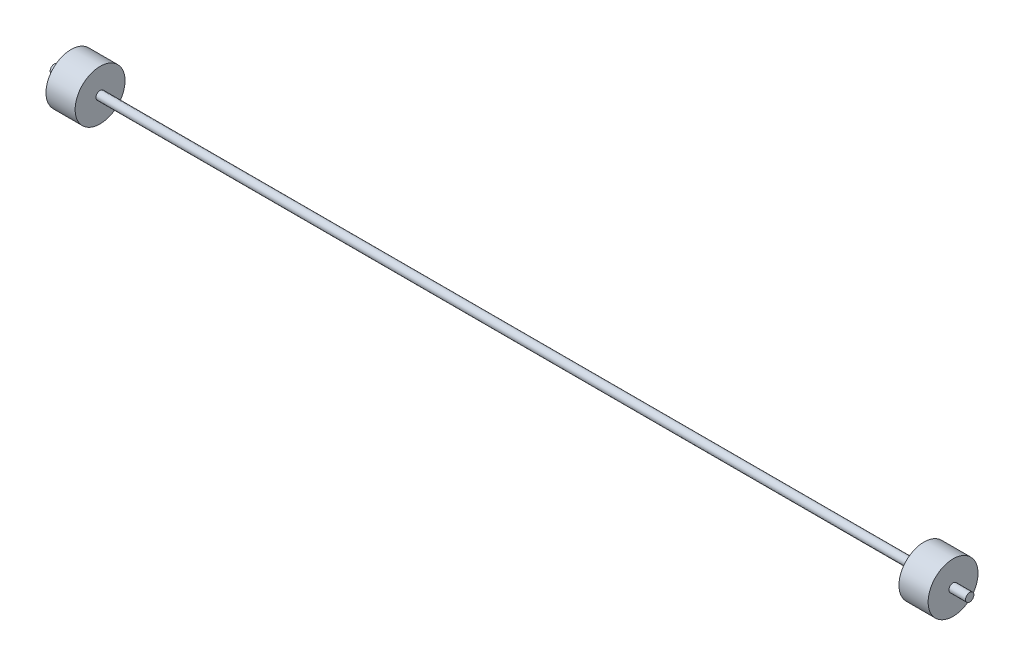
ISO-10303-21;
HEADER;
FILE_DESCRIPTION(('STEP AP214'),'2;1');
FILE_NAME('part.step','',(''),(''),'','','');
FILE_SCHEMA(('AUTOMOTIVE_DESIGN { 1 0 10303 214 1 1 1 1 }'));
ENDSEC;
DATA;
#1=APPLICATION_CONTEXT('core data for automotive mechanical design processes');
#2=APPLICATION_PROTOCOL_DEFINITION('international standard','automotive_design',2000,#1);
#3=PRODUCT_CONTEXT('',#1,'mechanical');
#4=PRODUCT('Part','Part','',(#3));
#5=PRODUCT_RELATED_PRODUCT_CATEGORY('part','',(#4));
#6=PRODUCT_DEFINITION_FORMATION('','',#4);
#7=PRODUCT_DEFINITION_CONTEXT('part definition',#1,'design');
#8=PRODUCT_DEFINITION('design','',#6,#7);
#9=PRODUCT_DEFINITION_SHAPE('','',#8);
#10=(LENGTH_UNIT() NAMED_UNIT(*) SI_UNIT(.MILLI.,.METRE.));
#11=(NAMED_UNIT(*) PLANE_ANGLE_UNIT() SI_UNIT($,.RADIAN.));
#12=(NAMED_UNIT(*) SI_UNIT($,.STERADIAN.) SOLID_ANGLE_UNIT());
#13=UNCERTAINTY_MEASURE_WITH_UNIT(LENGTH_MEASURE(1.E-05),#10,'distance_accuracy_value','');
#14=(GEOMETRIC_REPRESENTATION_CONTEXT(3) GLOBAL_UNCERTAINTY_ASSIGNED_CONTEXT((#13)) GLOBAL_UNIT_ASSIGNED_CONTEXT((#10,
#11,#12)) REPRESENTATION_CONTEXT('',''));
#15=CARTESIAN_POINT('',(0.,0.,0.));
#16=DIRECTION('',(0.,0.,1.));
#17=DIRECTION('',(1.,0.,0.));
#18=AXIS2_PLACEMENT_3D('',#15,#16,#17);
#19=CARTESIAN_POINT('',(-307.761103786618,76.2,0.));
#20=DIRECTION('',(-1.,0.,0.));
#21=DIRECTION('',(0.,0.,1.));
#22=AXIS2_PLACEMENT_3D('',#19,#20,#21);
#23=PLANE('',#22);
#24=CARTESIAN_POINT('',(-307.761103786618,0.,0.));
#25=DIRECTION('',(-1.,0.,0.));
#26=DIRECTION('',(0.,0.,1.));
#27=AXIS2_PLACEMENT_3D('',#24,#25,#26);
#28=CIRCLE('',#27,76.2);
#29=CARTESIAN_POINT('',(-307.761103786618,0.,76.2));
#30=VERTEX_POINT('',#29);
#31=EDGE_CURVE('E10',#30,#30,#28,.T.);
#32=ORIENTED_EDGE('',*,*,#31,.F.);
#33=EDGE_LOOP('',(#32));
#34=FACE_BOUND('',#33,.T.);
#35=CARTESIAN_POINT('',(-307.761103786618,0.,0.));
#36=DIRECTION('',(-1.,0.,0.));
#37=DIRECTION('',(0.,0.,1.));
#38=AXIS2_PLACEMENT_3D('',#35,#36,#37);
#39=CIRCLE('',#38,12.7);
#40=CARTESIAN_POINT('',(-307.761103786618,0.,12.7));
#41=VERTEX_POINT('',#40);
#42=EDGE_CURVE('E65',#41,#41,#39,.T.);
#43=ORIENTED_EDGE('',*,*,#42,.T.);
#44=EDGE_LOOP('',(#43));
#45=FACE_BOUND('',#44,.T.);
#46=ADVANCED_FACE('F31',(#34,#45),#23,.F.);
#47=CARTESIAN_POINT('',(-388.888679164739,0.,0.));
#48=DIRECTION('',(-1.,0.,0.));
#49=DIRECTION('',(0.,0.,1.));
#50=AXIS2_PLACEMENT_3D('',#47,#48,#49);
#51=CYLINDRICAL_SURFACE('',#50,76.2);
#52=CARTESIAN_POINT('',(-396.661103786618,0.,0.));
#53=DIRECTION('',(-1.,0.,0.));
#54=DIRECTION('',(0.,0.,1.));
#55=AXIS2_PLACEMENT_3D('',#52,#53,#54);
#56=CIRCLE('',#55,76.2);
#57=CARTESIAN_POINT('',(-396.661103786618,0.,76.2));
#58=VERTEX_POINT('',#57);
#59=EDGE_CURVE('E37',#58,#58,#56,.T.);
#60=ORIENTED_EDGE('',*,*,#59,.F.);
#61=EDGE_LOOP('',(#60));
#62=FACE_BOUND('',#61,.T.);
#63=ORIENTED_EDGE('',*,*,#31,.T.);
#64=EDGE_LOOP('',(#63));
#65=FACE_BOUND('',#64,.T.);
#66=ADVANCED_FACE('F111',(#62,#65),#51,.T.);
#67=CARTESIAN_POINT('',(-396.661103786618,76.2,0.));
#68=DIRECTION('',(1.,0.,0.));
#69=DIRECTION('',(0.,0.,-1.));
#70=AXIS2_PLACEMENT_3D('',#67,#68,#69);
#71=PLANE('',#70);
#72=CARTESIAN_POINT('',(-396.661103786618,0.,0.));
#73=DIRECTION('',(-1.,0.,0.));
#74=DIRECTION('',(0.,0.,1.));
#75=AXIS2_PLACEMENT_3D('',#72,#73,#74);
#76=CIRCLE('',#75,12.7);
#77=CARTESIAN_POINT('',(-396.661103786618,0.,12.7));
#78=VERTEX_POINT('',#77);
#79=EDGE_CURVE('E41',#78,#78,#76,.T.);
#80=ORIENTED_EDGE('',*,*,#79,.F.);
#81=EDGE_LOOP('',(#80));
#82=FACE_BOUND('',#81,.T.);
#83=ORIENTED_EDGE('',*,*,#59,.T.);
#84=EDGE_LOOP('',(#83));
#85=FACE_BOUND('',#84,.T.);
#86=ADVANCED_FACE('F116',(#82,#85),#71,.F.);
#87=CARTESIAN_POINT('',(-388.888679164739,0.,0.));
#88=DIRECTION('',(-1.,0.,0.));
#89=DIRECTION('',(0.,0.,1.));
#90=AXIS2_PLACEMENT_3D('',#87,#88,#89);
#91=CYLINDRICAL_SURFACE('',#90,12.7);
#92=CARTESIAN_POINT('',(-447.461103786618,0.,0.));
#93=DIRECTION('',(-1.,0.,0.));
#94=DIRECTION('',(0.,0.,1.));
#95=AXIS2_PLACEMENT_3D('',#92,#93,#94);
#96=CIRCLE('',#95,12.7);
#97=CARTESIAN_POINT('',(-447.461103786618,0.,12.7));
#98=VERTEX_POINT('',#97);
#99=EDGE_CURVE('E45',#98,#98,#96,.T.);
#100=ORIENTED_EDGE('',*,*,#99,.F.);
#101=EDGE_LOOP('',(#100));
#102=FACE_BOUND('',#101,.T.);
#103=ORIENTED_EDGE('',*,*,#79,.T.);
#104=EDGE_LOOP('',(#103));
#105=FACE_BOUND('',#104,.T.);
#106=ADVANCED_FACE('F107',(#102,#105),#91,.T.);
#107=CARTESIAN_POINT('',(-447.461103786618,12.7,0.));
#108=DIRECTION('',(1.,0.,0.));
#109=DIRECTION('',(0.,0.,-1.));
#110=AXIS2_PLACEMENT_3D('',#107,#108,#109);
#111=PLANE('',#110);
#112=ORIENTED_EDGE('',*,*,#99,.T.);
#113=EDGE_LOOP('',(#112));
#114=FACE_BOUND('',#113,.T.);
#115=ADVANCED_FACE('F102',(#114),#111,.F.);
#116=CARTESIAN_POINT('',(2346.53889621338,12.7000000000009,0.));
#117=DIRECTION('',(-1.,0.,0.));
#118=DIRECTION('',(0.,0.,1.));
#119=AXIS2_PLACEMENT_3D('',#116,#117,#118);
#120=PLANE('',#119);
#121=CARTESIAN_POINT('',(2346.53889621338,0.,0.));
#122=DIRECTION('',(-1.,0.,0.));
#123=DIRECTION('',(0.,0.,1.));
#124=AXIS2_PLACEMENT_3D('',#121,#122,#123);
#125=CIRCLE('',#124,12.7000000000009);
#126=CARTESIAN_POINT('',(2346.53889621338,0.,12.7000000000009));
#127=VERTEX_POINT('',#126);
#128=EDGE_CURVE('E50',#127,#127,#125,.T.);
#129=ORIENTED_EDGE('',*,*,#128,.F.);
#130=EDGE_LOOP('',(#129));
#131=FACE_BOUND('',#130,.T.);
#132=ADVANCED_FACE('F97',(#131),#120,.F.);
#133=CARTESIAN_POINT('',(-388.888679164739,0.,0.));
#134=DIRECTION('',(-1.,0.,0.));
#135=DIRECTION('',(0.,0.,1.));
#136=AXIS2_PLACEMENT_3D('',#133,#134,#135);
#137=CYLINDRICAL_SURFACE('',#136,12.7000000000004);
#138=CARTESIAN_POINT('',(2295.73889621338,0.,0.));
#139=DIRECTION('',(-1.,0.,0.));
#140=DIRECTION('',(0.,0.,1.));
#141=AXIS2_PLACEMENT_3D('',#138,#139,#140);
#142=CIRCLE('',#141,12.7);
#143=CARTESIAN_POINT('',(2295.73889621338,0.,12.7));
#144=VERTEX_POINT('',#143);
#145=EDGE_CURVE('E53',#144,#144,#142,.T.);
#146=ORIENTED_EDGE('',*,*,#145,.F.);
#147=EDGE_LOOP('',(#146));
#148=FACE_BOUND('',#147,.T.);
#149=ORIENTED_EDGE('',*,*,#128,.T.);
#150=EDGE_LOOP('',(#149));
#151=FACE_BOUND('',#150,.T.);
#152=ADVANCED_FACE('F91',(#148,#151),#137,.T.);
#153=CARTESIAN_POINT('',(2295.73889621338,76.1999999999998,0.));
#154=DIRECTION('',(-1.,0.,0.));
#155=DIRECTION('',(0.,0.,1.));
#156=AXIS2_PLACEMENT_3D('',#153,#154,#155);
#157=PLANE('',#156);
#158=CARTESIAN_POINT('',(2295.73889621338,0.,0.));
#159=DIRECTION('',(-1.,0.,0.));
#160=DIRECTION('',(0.,0.,1.));
#161=AXIS2_PLACEMENT_3D('',#158,#159,#160);
#162=CIRCLE('',#161,76.1999999999998);
#163=CARTESIAN_POINT('',(2295.73889621338,0.,76.1999999999998));
#164=VERTEX_POINT('',#163);
#165=EDGE_CURVE('E56',#164,#164,#162,.T.);
#166=ORIENTED_EDGE('',*,*,#165,.F.);
#167=EDGE_LOOP('',(#166));
#168=FACE_BOUND('',#167,.T.);
#169=ORIENTED_EDGE('',*,*,#145,.T.);
#170=EDGE_LOOP('',(#169));
#171=FACE_BOUND('',#170,.T.);
#172=ADVANCED_FACE('F85',(#168,#171),#157,.F.);
#173=CARTESIAN_POINT('',(-388.888679164739,0.,0.));
#174=DIRECTION('',(-1.,0.,0.));
#175=DIRECTION('',(0.,0.,1.));
#176=AXIS2_PLACEMENT_3D('',#173,#174,#175);
#177=CYLINDRICAL_SURFACE('',#176,76.1999999999998);
#178=CARTESIAN_POINT('',(2206.83889621338,0.,0.));
#179=DIRECTION('',(-1.,0.,0.));
#180=DIRECTION('',(0.,0.,1.));
#181=AXIS2_PLACEMENT_3D('',#178,#179,#180);
#182=CIRCLE('',#181,76.1999999999998);
#183=CARTESIAN_POINT('',(2206.83889621338,0.,76.1999999999998));
#184=VERTEX_POINT('',#183);
#185=EDGE_CURVE('E59',#184,#184,#182,.T.);
#186=ORIENTED_EDGE('',*,*,#185,.F.);
#187=EDGE_LOOP('',(#186));
#188=FACE_BOUND('',#187,.T.);
#189=ORIENTED_EDGE('',*,*,#165,.T.);
#190=EDGE_LOOP('',(#189));
#191=FACE_BOUND('',#190,.T.);
#192=ADVANCED_FACE('F79',(#188,#191),#177,.T.);
#193=CARTESIAN_POINT('',(2206.83889621338,12.7,0.));
#194=DIRECTION('',(1.,0.,0.));
#195=DIRECTION('',(0.,0.,-1.));
#196=AXIS2_PLACEMENT_3D('',#193,#194,#195);
#197=PLANE('',#196);
#198=CARTESIAN_POINT('',(2206.83889621338,0.,0.));
#199=DIRECTION('',(-1.,0.,0.));
#200=DIRECTION('',(0.,0.,1.));
#201=AXIS2_PLACEMENT_3D('',#198,#199,#200);
#202=CIRCLE('',#201,12.7);
#203=CARTESIAN_POINT('',(2206.83889621338,0.,12.7));
#204=VERTEX_POINT('',#203);
#205=EDGE_CURVE('E62',#204,#204,#202,.T.);
#206=ORIENTED_EDGE('',*,*,#205,.F.);
#207=EDGE_LOOP('',(#206));
#208=FACE_BOUND('',#207,.T.);
#209=ORIENTED_EDGE('',*,*,#185,.T.);
#210=EDGE_LOOP('',(#209));
#211=FACE_BOUND('',#210,.T.);
#212=ADVANCED_FACE('F73',(#208,#211),#197,.F.);
#213=CARTESIAN_POINT('',(-388.888679164739,0.,0.));
#214=DIRECTION('',(-1.,0.,0.));
#215=DIRECTION('',(0.,0.,1.));
#216=AXIS2_PLACEMENT_3D('',#213,#214,#215);
#217=CYLINDRICAL_SURFACE('',#216,12.7);
#218=ORIENTED_EDGE('',*,*,#42,.F.);
#219=EDGE_LOOP('',(#218));
#220=FACE_BOUND('',#219,.T.);
#221=ORIENTED_EDGE('',*,*,#205,.T.);
#222=EDGE_LOOP('',(#221));
#223=FACE_BOUND('',#222,.T.);
#224=ADVANCED_FACE('F70',(#220,#223),#217,.T.);
#225=CLOSED_SHELL('',(#46,#66,#86,#106,#115,#132,#152,#172,#192,#212,#224));
#226=MANIFOLD_SOLID_BREP('B2',#225);
#227=ADVANCED_BREP_SHAPE_REPRESENTATION('',(#18,#226),#14);
#228=SHAPE_DEFINITION_REPRESENTATION(#9,#227);
ENDSEC;
END-ISO-10303-21;
